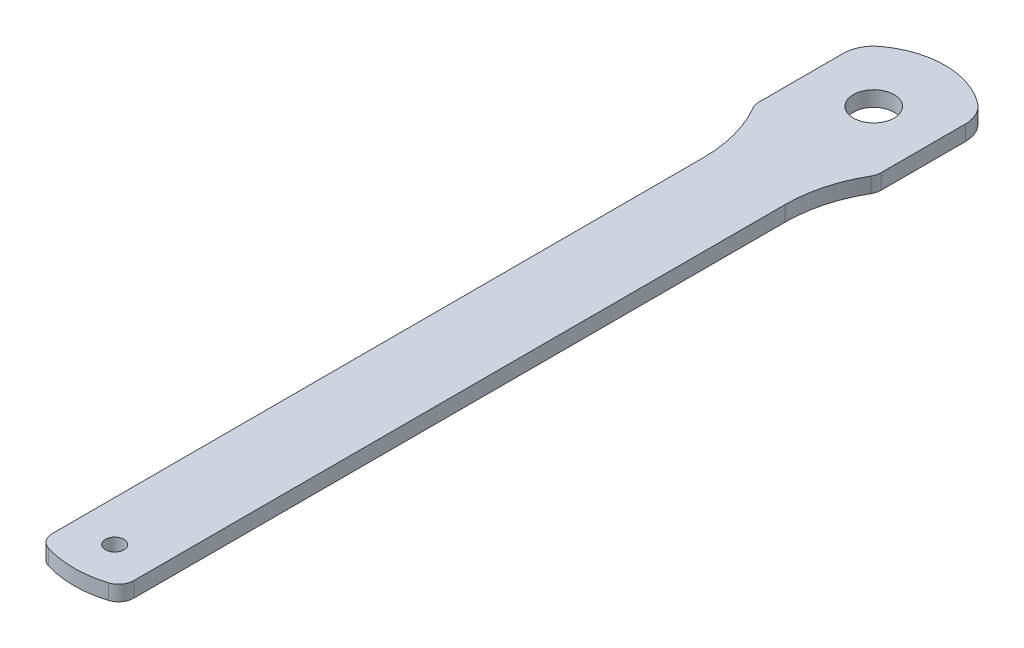
ISO-10303-21;
HEADER;
FILE_DESCRIPTION(('STEP AP214'),'2;1');
FILE_NAME('part.step','',(''),(''),'','','');
FILE_SCHEMA(('AUTOMOTIVE_DESIGN { 1 0 10303 214 1 1 1 1 }'));
ENDSEC;
DATA;
#1=APPLICATION_CONTEXT('core data for automotive mechanical design processes');
#2=APPLICATION_PROTOCOL_DEFINITION('international standard','automotive_design',2000,#1);
#3=PRODUCT_CONTEXT('',#1,'mechanical');
#4=PRODUCT('Part','Part','',(#3));
#5=PRODUCT_RELATED_PRODUCT_CATEGORY('part','',(#4));
#6=PRODUCT_DEFINITION_FORMATION('','',#4);
#7=PRODUCT_DEFINITION_CONTEXT('part definition',#1,'design');
#8=PRODUCT_DEFINITION('design','',#6,#7);
#9=PRODUCT_DEFINITION_SHAPE('','',#8);
#10=(LENGTH_UNIT() NAMED_UNIT(*) SI_UNIT(.MILLI.,.METRE.));
#11=(NAMED_UNIT(*) PLANE_ANGLE_UNIT() SI_UNIT($,.RADIAN.));
#12=(NAMED_UNIT(*) SI_UNIT($,.STERADIAN.) SOLID_ANGLE_UNIT());
#13=UNCERTAINTY_MEASURE_WITH_UNIT(LENGTH_MEASURE(1.E-05),#10,'distance_accuracy_value','');
#14=(GEOMETRIC_REPRESENTATION_CONTEXT(3) GLOBAL_UNCERTAINTY_ASSIGNED_CONTEXT((#13)) GLOBAL_UNIT_ASSIGNED_CONTEXT((#10,
#11,#12)) REPRESENTATION_CONTEXT('',''));
#15=CARTESIAN_POINT('',(0.,0.,0.));
#16=DIRECTION('',(0.,0.,1.));
#17=DIRECTION('',(1.,0.,0.));
#18=AXIS2_PLACEMENT_3D('',#15,#16,#17);
#19=CARTESIAN_POINT('',(-6.,-1.,-7.));
#20=DIRECTION('',(0.,-1.,0.));
#21=DIRECTION('',(0.,0.,-1.));
#22=AXIS2_PLACEMENT_3D('',#19,#20,#21);
#23=PLANE('',#22);
#24=CARTESIAN_POINT('',(0.,-1.,0.));
#25=DIRECTION('',(0.,-1.,0.));
#26=DIRECTION('',(0.,0.,-1.));
#27=AXIS2_PLACEMENT_3D('',#24,#25,#26);
#28=CIRCLE('',#27,2.);
#29=CARTESIAN_POINT('',(0.,-1.,-2.));
#30=VERTEX_POINT('',#29);
#31=EDGE_CURVE('E334',#30,#30,#28,.T.);
#32=ORIENTED_EDGE('',*,*,#31,.T.);
#33=EDGE_LOOP('',(#32));
#34=FACE_BOUND('',#33,.T.);
#35=CARTESIAN_POINT('',(17.25,-1.,12.7084973778708));
#36=DIRECTION('',(0.,-1.,0.));
#37=DIRECTION('',(0.,0.,-1.));
#38=AXIS2_PLACEMENT_3D('',#35,#36,#37);
#39=CIRCLE('',#38,13.25);
#40=CARTESIAN_POINT('',(5.79661016949153,-1.,6.04648856742895));
#41=VERTEX_POINT('',#40);
#42=CARTESIAN_POINT('',(4.,-1.,12.7084973778708));
#43=VERTEX_POINT('',#42);
#44=EDGE_CURVE('E330',#41,#43,#39,.F.);
#45=ORIENTED_EDGE('',*,*,#44,.F.);
#46=CARTESIAN_POINT('',(4.5,-1.,5.29229889077516));
#47=DIRECTION('',(0.,-1.,0.));
#48=DIRECTION('',(0.,0.,-1.));
#49=AXIS2_PLACEMENT_3D('',#46,#47,#48);
#50=CIRCLE('',#49,1.5);
#51=CARTESIAN_POINT('',(6.,-1.,5.29229889077516));
#52=VERTEX_POINT('',#51);
#53=EDGE_CURVE('E152',#41,#52,#50,.F.);
#54=ORIENTED_EDGE('',*,*,#53,.T.);
#55=DIRECTION('',(0.,0.,1.));
#56=VECTOR('',#55,1.);
#57=CARTESIAN_POINT('',(6.,-1.,-7.));
#58=LINE('',#57,#56);
#59=CARTESIAN_POINT('',(6.,-1.,-3.));
#60=VERTEX_POINT('',#59);
#61=EDGE_CURVE('E146',#60,#52,#58,.T.);
#62=ORIENTED_EDGE('',*,*,#61,.F.);
#63=CARTESIAN_POINT('',(3.,-1.,-3.));
#64=DIRECTION('',(0.,-1.,0.));
#65=DIRECTION('',(0.,0.,-1.));
#66=AXIS2_PLACEMENT_3D('',#63,#64,#65);
#67=CIRCLE('',#66,3.);
#68=CARTESIAN_POINT('',(4.8,-1.,-5.4));
#69=VERTEX_POINT('',#68);
#70=EDGE_CURVE('E149',#60,#69,#67,.F.);
#71=ORIENTED_EDGE('',*,*,#70,.T.);
#72=CARTESIAN_POINT('',(0.,-1.,1.));
#73=DIRECTION('',(0.,-1.,0.));
#74=DIRECTION('',(0.,0.,-1.));
#75=AXIS2_PLACEMENT_3D('',#72,#73,#74);
#76=CIRCLE('',#75,8.);
#77=CARTESIAN_POINT('',(-4.8,-1.,-5.4));
#78=VERTEX_POINT('',#77);
#79=EDGE_CURVE('E156',#78,#69,#76,.T.);
#80=ORIENTED_EDGE('',*,*,#79,.F.);
#81=CARTESIAN_POINT('',(-3.,-1.,-3.));
#82=DIRECTION('',(0.,-1.,0.));
#83=DIRECTION('',(0.,0.,-1.));
#84=AXIS2_PLACEMENT_3D('',#81,#82,#83);
#85=CIRCLE('',#84,3.);
#86=CARTESIAN_POINT('',(-6.,-1.,-3.));
#87=VERTEX_POINT('',#86);
#88=EDGE_CURVE('E254',#78,#87,#85,.F.);
#89=ORIENTED_EDGE('',*,*,#88,.T.);
#90=DIRECTION('',(0.,0.,1.));
#91=VECTOR('',#90,1.);
#92=CARTESIAN_POINT('',(-6.,-1.,-7.));
#93=LINE('',#92,#91);
#94=CARTESIAN_POINT('',(-6.,-1.,5.29229889077515));
#95=VERTEX_POINT('',#94);
#96=EDGE_CURVE('E157',#87,#95,#93,.T.);
#97=ORIENTED_EDGE('',*,*,#96,.T.);
#98=CARTESIAN_POINT('',(-4.5,-1.,5.29229889077516));
#99=DIRECTION('',(0.,-1.,0.));
#100=DIRECTION('',(0.,0.,-1.));
#101=AXIS2_PLACEMENT_3D('',#98,#99,#100);
#102=CIRCLE('',#101,1.5);
#103=CARTESIAN_POINT('',(-5.79661016949153,-1.,6.04648856742895));
#104=VERTEX_POINT('',#103);
#105=EDGE_CURVE('E258',#95,#104,#102,.F.);
#106=ORIENTED_EDGE('',*,*,#105,.T.);
#107=CARTESIAN_POINT('',(-17.25,-1.,12.7084973778708));
#108=DIRECTION('',(0.,-1.,0.));
#109=DIRECTION('',(0.,0.,-1.));
#110=AXIS2_PLACEMENT_3D('',#107,#108,#109);
#111=CIRCLE('',#110,13.25);
#112=CARTESIAN_POINT('',(-4.,-1.,12.7084973778708));
#113=VERTEX_POINT('',#112);
#114=EDGE_CURVE('E323',#113,#104,#111,.F.);
#115=ORIENTED_EDGE('',*,*,#114,.F.);
#116=DIRECTION('',(0.,0.,-1.));
#117=VECTOR('',#116,1.);
#118=CARTESIAN_POINT('',(-4.,-1.,77.7084973778708));
#119=LINE('',#118,#117);
#120=CARTESIAN_POINT('',(-4.,-1.,76.6673843925951));
#121=VERTEX_POINT('',#120);
#122=EDGE_CURVE('E326',#121,#113,#119,.T.);
#123=ORIENTED_EDGE('',*,*,#122,.F.);
#124=CARTESIAN_POINT('',(-2.5,-1.,76.6673843925951));
#125=DIRECTION('',(0.,-1.,0.));
#126=DIRECTION('',(0.,0.,-1.));
#127=AXIS2_PLACEMENT_3D('',#124,#125,#126);
#128=CIRCLE('',#127,1.5);
#129=CARTESIAN_POINT('',(-2.94117647058823,-1.,78.1010382287073));
#130=VERTEX_POINT('',#129);
#131=EDGE_CURVE('E54',#121,#130,#128,.F.);
#132=ORIENTED_EDGE('',*,*,#131,.T.);
#133=CARTESIAN_POINT('',(0.,-1.,68.5433459879591));
#134=DIRECTION('',(0.,-1.,0.));
#135=DIRECTION('',(0.,0.,-1.));
#136=AXIS2_PLACEMENT_3D('',#133,#134,#135);
#137=CIRCLE('',#136,10.);
#138=CARTESIAN_POINT('',(2.94117647058823,-1.,78.1010382287073));
#139=VERTEX_POINT('',#138);
#140=EDGE_CURVE('E177',#139,#130,#137,.T.);
#141=ORIENTED_EDGE('',*,*,#140,.F.);
#142=CARTESIAN_POINT('',(2.5,-1.,76.6673843925951));
#143=DIRECTION('',(0.,-1.,0.));
#144=DIRECTION('',(0.,0.,-1.));
#145=AXIS2_PLACEMENT_3D('',#142,#143,#144);
#146=CIRCLE('',#145,1.5);
#147=CARTESIAN_POINT('',(4.,-1.,76.6673843925951));
#148=VERTEX_POINT('',#147);
#149=EDGE_CURVE('E12',#139,#148,#146,.F.);
#150=ORIENTED_EDGE('',*,*,#149,.T.);
#151=DIRECTION('',(0.,0.,1.));
#152=VECTOR('',#151,1.);
#153=CARTESIAN_POINT('',(4.,-1.,12.7084973778708));
#154=LINE('',#153,#152);
#155=EDGE_CURVE('E67',#43,#148,#154,.T.);
#156=ORIENTED_EDGE('',*,*,#155,.F.);
#157=EDGE_LOOP('',(#45,#54,#62,#71,#80,#89,#97,#106,#115,#123,#132,#141,#150,#156));
#158=FACE_BOUND('',#157,.T.);
#159=CARTESIAN_POINT('',(0.,-1.,74.5433459879591));
#160=DIRECTION('',(0.,-1.,0.));
#161=DIRECTION('',(0.,0.,-1.));
#162=AXIS2_PLACEMENT_3D('',#159,#160,#161);
#163=CIRCLE('',#162,0.900000000000005);
#164=CARTESIAN_POINT('',(0.,-1.,73.6433459879591));
#165=VERTEX_POINT('',#164);
#166=EDGE_CURVE('E49',#165,#165,#163,.F.);
#167=ORIENTED_EDGE('',*,*,#166,.F.);
#168=EDGE_LOOP('',(#167));
#169=FACE_BOUND('',#168,.T.);
#170=ADVANCED_FACE('F45',(#34,#158,#169),#23,.F.);
#171=CARTESIAN_POINT('',(0.,2.5,68.5433459879591));
#172=DIRECTION('',(0.,-1.,0.));
#173=DIRECTION('',(0.,0.,-1.));
#174=AXIS2_PLACEMENT_3D('',#171,#172,#173);
#175=CYLINDRICAL_SURFACE('',#174,10.);
#176=DIRECTION('',(0.,-1.,0.));
#177=VECTOR('',#176,1.);
#178=CARTESIAN_POINT('',(2.94117647058823,2.5,78.1010382287073));
#179=LINE('',#178,#177);
#180=CARTESIAN_POINT('',(2.94117647058823,-2.5,78.1010382287073));
#181=VERTEX_POINT('',#180);
#182=EDGE_CURVE('E281',#181,#139,#179,.F.);
#183=ORIENTED_EDGE('',*,*,#182,.T.);
#184=ORIENTED_EDGE('',*,*,#140,.T.);
#185=DIRECTION('',(0.,-1.,0.));
#186=VECTOR('',#185,1.);
#187=CARTESIAN_POINT('',(-2.94117647058823,2.5,78.1010382287073));
#188=LINE('',#187,#186);
#189=CARTESIAN_POINT('',(-2.94117647058823,-2.5,78.1010382287073));
#190=VERTEX_POINT('',#189);
#191=EDGE_CURVE('E283',#130,#190,#188,.T.);
#192=ORIENTED_EDGE('',*,*,#191,.T.);
#193=CARTESIAN_POINT('',(0.,-2.5,68.5433459879591));
#194=DIRECTION('',(0.,1.,0.));
#195=DIRECTION('',(0.,0.,1.));
#196=AXIS2_PLACEMENT_3D('',#193,#194,#195);
#197=CIRCLE('',#196,10.);
#198=EDGE_CURVE('E342',#190,#181,#197,.T.);
#199=ORIENTED_EDGE('',*,*,#198,.T.);
#200=EDGE_LOOP('',(#183,#184,#192,#199));
#201=FACE_BOUND('',#200,.T.);
#202=ADVANCED_FACE('F186',(#201),#175,.T.);
#203=CARTESIAN_POINT('',(0.,2.5,1.));
#204=DIRECTION('',(0.,-1.,0.));
#205=DIRECTION('',(0.,0.,-1.));
#206=AXIS2_PLACEMENT_3D('',#203,#204,#205);
#207=CYLINDRICAL_SURFACE('',#206,8.);
#208=ORIENTED_EDGE('',*,*,#79,.T.);
#209=DIRECTION('',(0.,-1.,0.));
#210=VECTOR('',#209,1.);
#211=CARTESIAN_POINT('',(4.8,2.5,-5.4));
#212=LINE('',#211,#210);
#213=CARTESIAN_POINT('',(4.8,-2.5,-5.4));
#214=VERTEX_POINT('',#213);
#215=EDGE_CURVE('E163',#69,#214,#212,.T.);
#216=ORIENTED_EDGE('',*,*,#215,.T.);
#217=CARTESIAN_POINT('',(0.,-2.5,1.));
#218=DIRECTION('',(0.,1.,0.));
#219=DIRECTION('',(0.,0.,-1.));
#220=AXIS2_PLACEMENT_3D('',#217,#218,#219);
#221=CIRCLE('',#220,8.);
#222=CARTESIAN_POINT('',(-4.8,-2.5,-5.4));
#223=VERTEX_POINT('',#222);
#224=EDGE_CURVE('E262',#214,#223,#221,.T.);
#225=ORIENTED_EDGE('',*,*,#224,.T.);
#226=DIRECTION('',(0.,-1.,0.));
#227=VECTOR('',#226,1.);
#228=CARTESIAN_POINT('',(-4.8,2.5,-5.4));
#229=LINE('',#228,#227);
#230=EDGE_CURVE('E169',#223,#78,#229,.F.);
#231=ORIENTED_EDGE('',*,*,#230,.T.);
#232=EDGE_LOOP('',(#208,#216,#225,#231));
#233=FACE_BOUND('',#232,.T.);
#234=ADVANCED_FACE('F192',(#233),#207,.T.);
#235=CARTESIAN_POINT('',(17.25,2.5,12.7084973778708));
#236=DIRECTION('',(0.,-1.,0.));
#237=DIRECTION('',(0.,0.,-1.));
#238=AXIS2_PLACEMENT_3D('',#235,#236,#237);
#239=CYLINDRICAL_SURFACE('',#238,13.25);
#240=DIRECTION('',(0.,-1.,0.));
#241=VECTOR('',#240,1.);
#242=CARTESIAN_POINT('',(5.79661016949152,2.5,6.04648856742895));
#243=LINE('',#242,#241);
#244=CARTESIAN_POINT('',(5.79661016949152,-2.5,6.04648856742895));
#245=VERTEX_POINT('',#244);
#246=EDGE_CURVE('E301',#245,#41,#243,.F.);
#247=ORIENTED_EDGE('',*,*,#246,.T.);
#248=ORIENTED_EDGE('',*,*,#44,.T.);
#249=DIRECTION('',(0.,-1.,0.));
#250=VECTOR('',#249,1.);
#251=CARTESIAN_POINT('',(4.,2.5,12.7084973778708));
#252=LINE('',#251,#250);
#253=CARTESIAN_POINT('',(4.,-2.5,12.7084973778708));
#254=VERTEX_POINT('',#253);
#255=EDGE_CURVE('E279',#43,#254,#252,.T.);
#256=ORIENTED_EDGE('',*,*,#255,.T.);
#257=CARTESIAN_POINT('',(17.25,-2.5,12.7084973778708));
#258=DIRECTION('',(0.,-1.,0.));
#259=DIRECTION('',(0.,0.,1.));
#260=AXIS2_PLACEMENT_3D('',#257,#258,#259);
#261=CIRCLE('',#260,13.25);
#262=EDGE_CURVE('E268',#254,#245,#261,.T.);
#263=ORIENTED_EDGE('',*,*,#262,.T.);
#264=EDGE_LOOP('',(#247,#248,#256,#263));
#265=FACE_BOUND('',#264,.T.);
#266=ADVANCED_FACE('F209',(#265),#239,.F.);
#267=CARTESIAN_POINT('',(0.,-2.5,68.5433459879591));
#268=DIRECTION('',(0.,1.,0.));
#269=DIRECTION('',(0.,0.,1.));
#270=AXIS2_PLACEMENT_3D('',#267,#268,#269);
#271=PLANE('',#270);
#272=CARTESIAN_POINT('',(0.,-2.5,74.5433459879591));
#273=DIRECTION('',(0.,1.,0.));
#274=DIRECTION('',(0.,0.,1.));
#275=AXIS2_PLACEMENT_3D('',#272,#273,#274);
#276=CIRCLE('',#275,0.899999999999999);
#277=CARTESIAN_POINT('',(0.,-2.5,75.4433459879591));
#278=VERTEX_POINT('',#277);
#279=EDGE_CURVE('E336',#278,#278,#276,.T.);
#280=ORIENTED_EDGE('',*,*,#279,.T.);
#281=EDGE_LOOP('',(#280));
#282=FACE_BOUND('',#281,.T.);
#283=DIRECTION('',(0.,0.,1.));
#284=VECTOR('',#283,1.);
#285=CARTESIAN_POINT('',(-6.,-2.5,5.70849737787082));
#286=LINE('',#285,#284);
#287=CARTESIAN_POINT('',(-6.,-2.5,-3.));
#288=VERTEX_POINT('',#287);
#289=CARTESIAN_POINT('',(-6.,-2.5,5.29229889077516));
#290=VERTEX_POINT('',#289);
#291=EDGE_CURVE('E264',#288,#290,#286,.T.);
#292=ORIENTED_EDGE('',*,*,#291,.F.);
#293=CARTESIAN_POINT('',(-3.,-2.5,-3.));
#294=DIRECTION('',(0.,1.,0.));
#295=DIRECTION('',(0.,0.,1.));
#296=AXIS2_PLACEMENT_3D('',#293,#294,#295);
#297=CIRCLE('',#296,3.);
#298=EDGE_CURVE('E312',#288,#223,#297,.F.);
#299=ORIENTED_EDGE('',*,*,#298,.T.);
#300=ORIENTED_EDGE('',*,*,#224,.F.);
#301=CARTESIAN_POINT('',(3.,-2.5,-3.));
#302=DIRECTION('',(0.,1.,0.));
#303=DIRECTION('',(0.,0.,1.));
#304=AXIS2_PLACEMENT_3D('',#301,#302,#303);
#305=CIRCLE('',#304,3.);
#306=CARTESIAN_POINT('',(6.,-2.5,-3.));
#307=VERTEX_POINT('',#306);
#308=EDGE_CURVE('E310',#214,#307,#305,.F.);
#309=ORIENTED_EDGE('',*,*,#308,.T.);
#310=DIRECTION('',(0.,0.,-1.));
#311=VECTOR('',#310,1.);
#312=CARTESIAN_POINT('',(6.,-2.5,-4.29150262212918));
#313=LINE('',#312,#311);
#314=CARTESIAN_POINT('',(6.,-2.5,5.29229889077515));
#315=VERTEX_POINT('',#314);
#316=EDGE_CURVE('E168',#315,#307,#313,.T.);
#317=ORIENTED_EDGE('',*,*,#316,.F.);
#318=CARTESIAN_POINT('',(4.5,-2.5,5.29229889077516));
#319=DIRECTION('',(0.,1.,0.));
#320=DIRECTION('',(0.,0.,1.));
#321=AXIS2_PLACEMENT_3D('',#318,#319,#320);
#322=CIRCLE('',#321,1.5);
#323=EDGE_CURVE('E299',#315,#245,#322,.F.);
#324=ORIENTED_EDGE('',*,*,#323,.T.);
#325=ORIENTED_EDGE('',*,*,#262,.F.);
#326=DIRECTION('',(0.,0.,-1.));
#327=VECTOR('',#326,1.);
#328=CARTESIAN_POINT('',(4.,-2.5,12.7084973778708));
#329=LINE('',#328,#327);
#330=CARTESIAN_POINT('',(4.,-2.5,76.6673843925951));
#331=VERTEX_POINT('',#330);
#332=EDGE_CURVE('E345',#331,#254,#329,.T.);
#333=ORIENTED_EDGE('',*,*,#332,.F.);
#334=CARTESIAN_POINT('',(2.5,-2.5,76.6673843925951));
#335=DIRECTION('',(0.,1.,0.));
#336=DIRECTION('',(0.,0.,1.));
#337=AXIS2_PLACEMENT_3D('',#334,#335,#336);
#338=CIRCLE('',#337,1.5);
#339=EDGE_CURVE('E285',#331,#181,#338,.F.);
#340=ORIENTED_EDGE('',*,*,#339,.T.);
#341=ORIENTED_EDGE('',*,*,#198,.F.);
#342=CARTESIAN_POINT('',(-2.5,-2.5,76.6673843925951));
#343=DIRECTION('',(0.,1.,0.));
#344=DIRECTION('',(0.,0.,1.));
#345=AXIS2_PLACEMENT_3D('',#342,#343,#344);
#346=CIRCLE('',#345,1.5);
#347=CARTESIAN_POINT('',(-4.,-2.5,76.6673843925951));
#348=VERTEX_POINT('',#347);
#349=EDGE_CURVE('E287',#190,#348,#346,.F.);
#350=ORIENTED_EDGE('',*,*,#349,.T.);
#351=DIRECTION('',(0.,0.,1.));
#352=VECTOR('',#351,1.);
#353=CARTESIAN_POINT('',(-4.,-2.5,77.7084973778708));
#354=LINE('',#353,#352);
#355=CARTESIAN_POINT('',(-4.,-2.5,12.7084973778708));
#356=VERTEX_POINT('',#355);
#357=EDGE_CURVE('E274',#356,#348,#354,.T.);
#358=ORIENTED_EDGE('',*,*,#357,.F.);
#359=CARTESIAN_POINT('',(-17.25,-2.5,12.7084973778708));
#360=DIRECTION('',(0.,-1.,0.));
#361=DIRECTION('',(0.,0.,1.));
#362=AXIS2_PLACEMENT_3D('',#359,#360,#361);
#363=CIRCLE('',#362,13.25);
#364=CARTESIAN_POINT('',(-5.79661016949152,-2.5,6.04648856742895));
#365=VERTEX_POINT('',#364);
#366=EDGE_CURVE('E266',#365,#356,#363,.T.);
#367=ORIENTED_EDGE('',*,*,#366,.F.);
#368=CARTESIAN_POINT('',(-4.5,-2.5,5.29229889077516));
#369=DIRECTION('',(0.,1.,0.));
#370=DIRECTION('',(0.,0.,1.));
#371=AXIS2_PLACEMENT_3D('',#368,#369,#370);
#372=CIRCLE('',#371,1.5);
#373=EDGE_CURVE('E296',#365,#290,#372,.F.);
#374=ORIENTED_EDGE('',*,*,#373,.T.);
#375=EDGE_LOOP('',(#292,#299,#300,#309,#317,#324,#325,#333,#340,#341,#350,#358,#367,#374));
#376=FACE_BOUND('',#375,.T.);
#377=CARTESIAN_POINT('',(0.,-2.5,0.));
#378=DIRECTION('',(0.,1.,0.));
#379=DIRECTION('',(0.,0.,1.));
#380=AXIS2_PLACEMENT_3D('',#377,#378,#379);
#381=CIRCLE('',#380,2.);
#382=CARTESIAN_POINT('',(0.,-2.5,2.));
#383=VERTEX_POINT('',#382);
#384=EDGE_CURVE('E339',#383,#383,#381,.T.);
#385=ORIENTED_EDGE('',*,*,#384,.T.);
#386=EDGE_LOOP('',(#385));
#387=FACE_BOUND('',#386,.T.);
#388=ADVANCED_FACE('F205',(#282,#376,#387),#271,.F.);
#389=CARTESIAN_POINT('',(4.5,2.5,5.29229889077516));
#390=DIRECTION('',(0.,-1.,0.));
#391=DIRECTION('',(0.,0.,-1.));
#392=AXIS2_PLACEMENT_3D('',#389,#390,#391);
#393=CYLINDRICAL_SURFACE('',#392,1.5);
#394=ORIENTED_EDGE('',*,*,#53,.F.);
#395=ORIENTED_EDGE('',*,*,#246,.F.);
#396=ORIENTED_EDGE('',*,*,#323,.F.);
#397=DIRECTION('',(0.,-1.,0.));
#398=VECTOR('',#397,1.);
#399=CARTESIAN_POINT('',(6.,2.5,5.29229889077515));
#400=LINE('',#399,#398);
#401=EDGE_CURVE('E294',#52,#315,#400,.T.);
#402=ORIENTED_EDGE('',*,*,#401,.F.);
#403=EDGE_LOOP('',(#394,#395,#396,#402));
#404=FACE_BOUND('',#403,.T.);
#405=ADVANCED_FACE('F208',(#404),#393,.T.);
#406=CARTESIAN_POINT('',(3.,2.5,-3.));
#407=DIRECTION('',(0.,-1.,0.));
#408=DIRECTION('',(0.,0.,-1.));
#409=AXIS2_PLACEMENT_3D('',#406,#407,#408);
#410=CYLINDRICAL_SURFACE('',#409,3.);
#411=ORIENTED_EDGE('',*,*,#70,.F.);
#412=DIRECTION('',(0.,-1.,0.));
#413=VECTOR('',#412,1.);
#414=CARTESIAN_POINT('',(6.,2.5,-3.));
#415=LINE('',#414,#413);
#416=EDGE_CURVE('E162',#307,#60,#415,.F.);
#417=ORIENTED_EDGE('',*,*,#416,.F.);
#418=ORIENTED_EDGE('',*,*,#308,.F.);
#419=ORIENTED_EDGE('',*,*,#215,.F.);
#420=EDGE_LOOP('',(#411,#417,#418,#419));
#421=FACE_BOUND('',#420,.T.);
#422=ADVANCED_FACE('F47',(#421),#410,.T.);
#423=CARTESIAN_POINT('',(6.,2.5,-4.29150262212918));
#424=DIRECTION('',(-1.,0.,0.));
#425=DIRECTION('',(0.,0.,1.));
#426=AXIS2_PLACEMENT_3D('',#423,#424,#425);
#427=PLANE('',#426);
#428=ORIENTED_EDGE('',*,*,#416,.T.);
#429=ORIENTED_EDGE('',*,*,#61,.T.);
#430=ORIENTED_EDGE('',*,*,#401,.T.);
#431=ORIENTED_EDGE('',*,*,#316,.T.);
#432=EDGE_LOOP('',(#428,#429,#430,#431));
#433=FACE_BOUND('',#432,.T.);
#434=ADVANCED_FACE('F166',(#433),#427,.F.);
#435=CARTESIAN_POINT('',(-3.,2.5,-3.));
#436=DIRECTION('',(0.,-1.,0.));
#437=DIRECTION('',(0.,0.,-1.));
#438=AXIS2_PLACEMENT_3D('',#435,#436,#437);
#439=CYLINDRICAL_SURFACE('',#438,3.);
#440=ORIENTED_EDGE('',*,*,#88,.F.);
#441=ORIENTED_EDGE('',*,*,#230,.F.);
#442=ORIENTED_EDGE('',*,*,#298,.F.);
#443=DIRECTION('',(0.,-1.,0.));
#444=VECTOR('',#443,1.);
#445=CARTESIAN_POINT('',(-6.,2.5,-3.));
#446=LINE('',#445,#444);
#447=EDGE_CURVE('E256',#87,#288,#446,.T.);
#448=ORIENTED_EDGE('',*,*,#447,.F.);
#449=EDGE_LOOP('',(#440,#441,#442,#448));
#450=FACE_BOUND('',#449,.T.);
#451=ADVANCED_FACE('F231',(#450),#439,.T.);
#452=CARTESIAN_POINT('',(-4.5,2.5,5.29229889077516));
#453=DIRECTION('',(0.,-1.,0.));
#454=DIRECTION('',(0.,0.,-1.));
#455=AXIS2_PLACEMENT_3D('',#452,#453,#454);
#456=CYLINDRICAL_SURFACE('',#455,1.5);
#457=ORIENTED_EDGE('',*,*,#105,.F.);
#458=DIRECTION('',(0.,-1.,0.));
#459=VECTOR('',#458,1.);
#460=CARTESIAN_POINT('',(-6.,2.5,5.29229889077516));
#461=LINE('',#460,#459);
#462=EDGE_CURVE('E306',#290,#95,#461,.F.);
#463=ORIENTED_EDGE('',*,*,#462,.F.);
#464=ORIENTED_EDGE('',*,*,#373,.F.);
#465=DIRECTION('',(0.,-1.,0.));
#466=VECTOR('',#465,1.);
#467=CARTESIAN_POINT('',(-5.79661016949152,2.5,6.04648856742895));
#468=LINE('',#467,#466);
#469=EDGE_CURVE('E304',#104,#365,#468,.T.);
#470=ORIENTED_EDGE('',*,*,#469,.F.);
#471=EDGE_LOOP('',(#457,#463,#464,#470));
#472=FACE_BOUND('',#471,.T.);
#473=ADVANCED_FACE('F224',(#472),#456,.T.);
#474=CARTESIAN_POINT('',(-6.,2.5,5.70849737787082));
#475=DIRECTION('',(1.,0.,0.));
#476=DIRECTION('',(0.,0.,-1.));
#477=AXIS2_PLACEMENT_3D('',#474,#475,#476);
#478=PLANE('',#477);
#479=ORIENTED_EDGE('',*,*,#462,.T.);
#480=ORIENTED_EDGE('',*,*,#96,.F.);
#481=ORIENTED_EDGE('',*,*,#447,.T.);
#482=ORIENTED_EDGE('',*,*,#291,.T.);
#483=EDGE_LOOP('',(#479,#480,#481,#482));
#484=FACE_BOUND('',#483,.T.);
#485=ADVANCED_FACE('F220',(#484),#478,.F.);
#486=CARTESIAN_POINT('',(2.5,2.5,76.6673843925951));
#487=DIRECTION('',(0.,-1.,0.));
#488=DIRECTION('',(0.,0.,-1.));
#489=AXIS2_PLACEMENT_3D('',#486,#487,#488);
#490=CYLINDRICAL_SURFACE('',#489,1.5);
#491=ORIENTED_EDGE('',*,*,#149,.F.);
#492=ORIENTED_EDGE('',*,*,#182,.F.);
#493=ORIENTED_EDGE('',*,*,#339,.F.);
#494=DIRECTION('',(0.,-1.,0.));
#495=VECTOR('',#494,1.);
#496=CARTESIAN_POINT('',(4.,2.5,76.6673843925951));
#497=LINE('',#496,#495);
#498=EDGE_CURVE('E292',#148,#331,#497,.T.);
#499=ORIENTED_EDGE('',*,*,#498,.F.);
#500=EDGE_LOOP('',(#491,#492,#493,#499));
#501=FACE_BOUND('',#500,.T.);
#502=ADVANCED_FACE('F223',(#501),#490,.T.);
#503=CARTESIAN_POINT('',(4.,2.5,12.7084973778708));
#504=DIRECTION('',(-1.,0.,0.));
#505=DIRECTION('',(0.,0.,1.));
#506=AXIS2_PLACEMENT_3D('',#503,#504,#505);
#507=PLANE('',#506);
#508=ORIENTED_EDGE('',*,*,#155,.T.);
#509=ORIENTED_EDGE('',*,*,#498,.T.);
#510=ORIENTED_EDGE('',*,*,#332,.T.);
#511=ORIENTED_EDGE('',*,*,#255,.F.);
#512=EDGE_LOOP('',(#508,#509,#510,#511));
#513=FACE_BOUND('',#512,.T.);
#514=ADVANCED_FACE('F218',(#513),#507,.F.);
#515=CARTESIAN_POINT('',(-17.25,2.5,12.7084973778708));
#516=DIRECTION('',(0.,-1.,0.));
#517=DIRECTION('',(0.,0.,-1.));
#518=AXIS2_PLACEMENT_3D('',#515,#516,#517);
#519=CYLINDRICAL_SURFACE('',#518,13.25);
#520=DIRECTION('',(0.,-1.,0.));
#521=VECTOR('',#520,1.);
#522=CARTESIAN_POINT('',(-4.,2.5,12.7084973778708));
#523=LINE('',#522,#521);
#524=EDGE_CURVE('E277',#113,#356,#523,.T.);
#525=ORIENTED_EDGE('',*,*,#524,.F.);
#526=ORIENTED_EDGE('',*,*,#114,.T.);
#527=ORIENTED_EDGE('',*,*,#469,.T.);
#528=ORIENTED_EDGE('',*,*,#366,.T.);
#529=EDGE_LOOP('',(#525,#526,#527,#528));
#530=FACE_BOUND('',#529,.T.);
#531=ADVANCED_FACE('F215',(#530),#519,.F.);
#532=CARTESIAN_POINT('',(-2.5,2.5,76.6673843925951));
#533=DIRECTION('',(0.,-1.,0.));
#534=DIRECTION('',(0.,0.,-1.));
#535=AXIS2_PLACEMENT_3D('',#532,#533,#534);
#536=CYLINDRICAL_SURFACE('',#535,1.5);
#537=ORIENTED_EDGE('',*,*,#131,.F.);
#538=DIRECTION('',(0.,-1.,0.));
#539=VECTOR('',#538,1.);
#540=CARTESIAN_POINT('',(-4.,2.5,76.6673843925951));
#541=LINE('',#540,#539);
#542=EDGE_CURVE('E289',#348,#121,#541,.F.);
#543=ORIENTED_EDGE('',*,*,#542,.F.);
#544=ORIENTED_EDGE('',*,*,#349,.F.);
#545=ORIENTED_EDGE('',*,*,#191,.F.);
#546=EDGE_LOOP('',(#537,#543,#544,#545));
#547=FACE_BOUND('',#546,.T.);
#548=ADVANCED_FACE('F213',(#547),#536,.T.);
#549=CARTESIAN_POINT('',(-4.,2.5,77.7084973778708));
#550=DIRECTION('',(1.,0.,0.));
#551=DIRECTION('',(0.,0.,-1.));
#552=AXIS2_PLACEMENT_3D('',#549,#550,#551);
#553=PLANE('',#552);
#554=ORIENTED_EDGE('',*,*,#542,.T.);
#555=ORIENTED_EDGE('',*,*,#122,.T.);
#556=ORIENTED_EDGE('',*,*,#524,.T.);
#557=ORIENTED_EDGE('',*,*,#357,.T.);
#558=EDGE_LOOP('',(#554,#555,#556,#557));
#559=FACE_BOUND('',#558,.T.);
#560=ADVANCED_FACE('F201',(#559),#553,.F.);
#561=CARTESIAN_POINT('',(0.,2.5,0.));
#562=DIRECTION('',(0.,-1.,0.));
#563=DIRECTION('',(0.,0.,-1.));
#564=AXIS2_PLACEMENT_3D('',#561,#562,#563);
#565=CYLINDRICAL_SURFACE('',#564,2.);
#566=ORIENTED_EDGE('',*,*,#31,.F.);
#567=EDGE_LOOP('',(#566));
#568=FACE_BOUND('',#567,.T.);
#569=ORIENTED_EDGE('',*,*,#384,.F.);
#570=EDGE_LOOP('',(#569));
#571=FACE_BOUND('',#570,.T.);
#572=ADVANCED_FACE('F197',(#568,#571),#565,.F.);
#573=CARTESIAN_POINT('',(0.,2.,74.5433459879591));
#574=DIRECTION('',(0.,1.,0.));
#575=DIRECTION('',(0.,0.,1.));
#576=AXIS2_PLACEMENT_3D('',#573,#574,#575);
#577=CYLINDRICAL_SURFACE('',#576,0.900000000000005);
#578=ORIENTED_EDGE('',*,*,#166,.T.);
#579=EDGE_LOOP('',(#578));
#580=FACE_BOUND('',#579,.T.);
#581=ORIENTED_EDGE('',*,*,#279,.F.);
#582=EDGE_LOOP('',(#581));
#583=FACE_BOUND('',#582,.T.);
#584=ADVANCED_FACE('F183',(#580,#583),#577,.F.);
#585=CLOSED_SHELL('',(#170,#202,#234,#266,#388,#405,#422,#434,#451,#473,#485,#502,#514,#531,
#548,#560,#572,#584));
#586=MANIFOLD_SOLID_BREP('B2',#585);
#587=ADVANCED_BREP_SHAPE_REPRESENTATION('',(#18,#586),#14);
#588=SHAPE_DEFINITION_REPRESENTATION(#9,#587);
ENDSEC;
END-ISO-10303-21;
